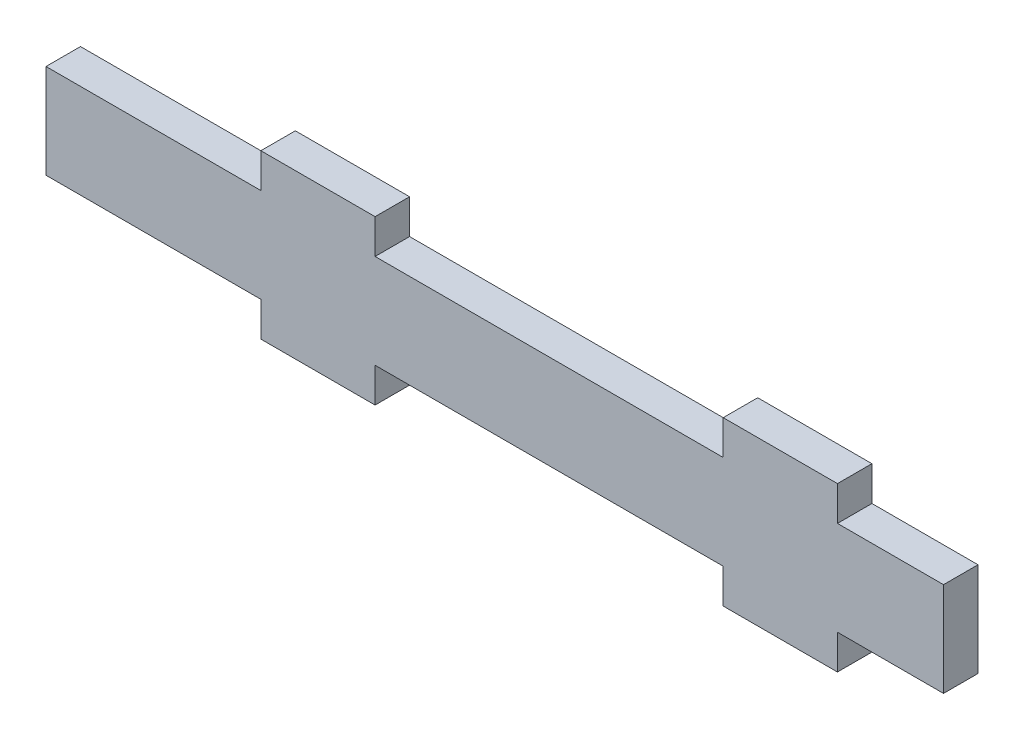
ISO-10303-21;
HEADER;
FILE_DESCRIPTION(('STEP AP214'),'2;1');
FILE_NAME('part.step','',(''),(''),'','','');
FILE_SCHEMA(('AUTOMOTIVE_DESIGN { 1 0 10303 214 1 1 1 1 }'));
ENDSEC;
DATA;
#1=APPLICATION_CONTEXT('core data for automotive mechanical design processes');
#2=APPLICATION_PROTOCOL_DEFINITION('international standard','automotive_design',2000,#1);
#3=PRODUCT_CONTEXT('',#1,'mechanical');
#4=PRODUCT('Part','Part','',(#3));
#5=PRODUCT_RELATED_PRODUCT_CATEGORY('part','',(#4));
#6=PRODUCT_DEFINITION_FORMATION('','',#4);
#7=PRODUCT_DEFINITION_CONTEXT('part definition',#1,'design');
#8=PRODUCT_DEFINITION('design','',#6,#7);
#9=PRODUCT_DEFINITION_SHAPE('','',#8);
#10=(LENGTH_UNIT() NAMED_UNIT(*) SI_UNIT(.MILLI.,.METRE.));
#11=(NAMED_UNIT(*) PLANE_ANGLE_UNIT() SI_UNIT($,.RADIAN.));
#12=(NAMED_UNIT(*) SI_UNIT($,.STERADIAN.) SOLID_ANGLE_UNIT());
#13=UNCERTAINTY_MEASURE_WITH_UNIT(LENGTH_MEASURE(1.E-05),#10,'distance_accuracy_value','');
#14=(GEOMETRIC_REPRESENTATION_CONTEXT(3) GLOBAL_UNCERTAINTY_ASSIGNED_CONTEXT((#13)) GLOBAL_UNIT_ASSIGNED_CONTEXT((#10,
#11,#12)) REPRESENTATION_CONTEXT('',''));
#15=CARTESIAN_POINT('',(0.,0.,0.));
#16=DIRECTION('',(0.,0.,1.));
#17=DIRECTION('',(1.,0.,0.));
#18=AXIS2_PLACEMENT_3D('',#15,#16,#17);
#19=CARTESIAN_POINT('',(0.,8.65999999999999,3.17));
#20=DIRECTION('',(0.,1.,0.));
#21=DIRECTION('',(-1.,0.,0.));
#22=AXIS2_PLACEMENT_3D('',#19,#20,#21);
#23=PLANE('',#22);
#24=DIRECTION('',(1.,0.,0.));
#25=VECTOR('',#24,1.);
#26=CARTESIAN_POINT('',(0.,8.65999999999999,0.));
#27=LINE('',#26,#25);
#28=CARTESIAN_POINT('',(0.,8.65999999999999,0.));
#29=VERTEX_POINT('',#28);
#30=CARTESIAN_POINT('',(19.75,8.66,0.));
#31=VERTEX_POINT('',#30);
#32=EDGE_CURVE('E230',#29,#31,#27,.T.);
#33=ORIENTED_EDGE('',*,*,#32,.F.);
#34=DIRECTION('',(0.,0.,-1.));
#35=VECTOR('',#34,1.);
#36=CARTESIAN_POINT('',(0.,8.65999999999999,3.17));
#37=LINE('',#36,#35);
#38=CARTESIAN_POINT('',(0.,8.65999999999999,3.17));
#39=VERTEX_POINT('',#38);
#40=EDGE_CURVE('E256',#39,#29,#37,.T.);
#41=ORIENTED_EDGE('',*,*,#40,.F.);
#42=DIRECTION('',(1.,0.,0.));
#43=VECTOR('',#42,1.);
#44=CARTESIAN_POINT('',(0.,8.65999999999999,3.17));
#45=LINE('',#44,#43);
#46=CARTESIAN_POINT('',(19.75,8.66,3.17));
#47=VERTEX_POINT('',#46);
#48=EDGE_CURVE('E350',#39,#47,#45,.T.);
#49=ORIENTED_EDGE('',*,*,#48,.T.);
#50=DIRECTION('',(0.,0.,-1.));
#51=VECTOR('',#50,1.);
#52=CARTESIAN_POINT('',(19.75,8.66,3.17));
#53=LINE('',#52,#51);
#54=EDGE_CURVE('E259',#47,#31,#53,.T.);
#55=ORIENTED_EDGE('',*,*,#54,.T.);
#56=EDGE_LOOP('',(#33,#41,#49,#55));
#57=FACE_BOUND('',#56,.T.);
#58=ADVANCED_FACE('F83',(#57),#23,.T.);
#59=CARTESIAN_POINT('',(19.75,0.,3.17));
#60=DIRECTION('',(-1.,0.,0.));
#61=DIRECTION('',(0.,0.,1.));
#62=AXIS2_PLACEMENT_3D('',#59,#60,#61);
#63=PLANE('',#62);
#64=DIRECTION('',(0.,1.,0.));
#65=VECTOR('',#64,1.);
#66=CARTESIAN_POINT('',(19.75,0.,0.));
#67=LINE('',#66,#65);
#68=CARTESIAN_POINT('',(19.75,11.83,0.));
#69=VERTEX_POINT('',#68);
#70=EDGE_CURVE('E246',#31,#69,#67,.T.);
#71=ORIENTED_EDGE('',*,*,#70,.F.);
#72=ORIENTED_EDGE('',*,*,#54,.F.);
#73=DIRECTION('',(0.,1.,0.));
#74=VECTOR('',#73,1.);
#75=CARTESIAN_POINT('',(19.75,0.,3.17));
#76=LINE('',#75,#74);
#77=CARTESIAN_POINT('',(19.75,11.83,3.17));
#78=VERTEX_POINT('',#77);
#79=EDGE_CURVE('E364',#47,#78,#76,.T.);
#80=ORIENTED_EDGE('',*,*,#79,.T.);
#81=DIRECTION('',(0.,0.,-1.));
#82=VECTOR('',#81,1.);
#83=CARTESIAN_POINT('',(19.75,11.83,3.17));
#84=LINE('',#83,#82);
#85=EDGE_CURVE('E262',#78,#69,#84,.T.);
#86=ORIENTED_EDGE('',*,*,#85,.T.);
#87=EDGE_LOOP('',(#71,#72,#80,#86));
#88=FACE_BOUND('',#87,.T.);
#89=ADVANCED_FACE('F415',(#88),#63,.T.);
#90=CARTESIAN_POINT('',(0.,11.83,3.17));
#91=DIRECTION('',(0.,1.,0.));
#92=DIRECTION('',(-1.,0.,0.));
#93=AXIS2_PLACEMENT_3D('',#90,#91,#92);
#94=PLANE('',#93);
#95=DIRECTION('',(1.,0.,0.));
#96=VECTOR('',#95,1.);
#97=CARTESIAN_POINT('',(0.,11.83,0.));
#98=LINE('',#97,#96);
#99=CARTESIAN_POINT('',(30.25,11.83,0.));
#100=VERTEX_POINT('',#99);
#101=EDGE_CURVE('E243',#69,#100,#98,.T.);
#102=ORIENTED_EDGE('',*,*,#101,.F.);
#103=ORIENTED_EDGE('',*,*,#85,.F.);
#104=DIRECTION('',(1.,0.,0.));
#105=VECTOR('',#104,1.);
#106=CARTESIAN_POINT('',(0.,11.83,3.17));
#107=LINE('',#106,#105);
#108=CARTESIAN_POINT('',(30.25,11.83,3.17));
#109=VERTEX_POINT('',#108);
#110=EDGE_CURVE('E362',#78,#109,#107,.T.);
#111=ORIENTED_EDGE('',*,*,#110,.T.);
#112=DIRECTION('',(0.,0.,-1.));
#113=VECTOR('',#112,1.);
#114=CARTESIAN_POINT('',(30.25,11.83,3.17));
#115=LINE('',#114,#113);
#116=EDGE_CURVE('E265',#109,#100,#115,.T.);
#117=ORIENTED_EDGE('',*,*,#116,.T.);
#118=EDGE_LOOP('',(#102,#103,#111,#117));
#119=FACE_BOUND('',#118,.T.);
#120=ADVANCED_FACE('F413',(#119),#94,.T.);
#121=CARTESIAN_POINT('',(30.25,0.,3.17));
#122=DIRECTION('',(-1.,0.,0.));
#123=DIRECTION('',(0.,-1.,0.));
#124=AXIS2_PLACEMENT_3D('',#121,#122,#123);
#125=PLANE('',#124);
#126=DIRECTION('',(0.,1.,0.));
#127=VECTOR('',#126,1.);
#128=CARTESIAN_POINT('',(30.25,0.,0.));
#129=LINE('',#128,#127);
#130=CARTESIAN_POINT('',(30.25,8.66,0.));
#131=VERTEX_POINT('',#130);
#132=EDGE_CURVE('E240',#131,#100,#129,.T.);
#133=ORIENTED_EDGE('',*,*,#132,.T.);
#134=ORIENTED_EDGE('',*,*,#116,.F.);
#135=DIRECTION('',(0.,1.,0.));
#136=VECTOR('',#135,1.);
#137=CARTESIAN_POINT('',(30.25,0.,3.17));
#138=LINE('',#137,#136);
#139=CARTESIAN_POINT('',(30.25,8.66,3.17));
#140=VERTEX_POINT('',#139);
#141=EDGE_CURVE('E359',#140,#109,#138,.T.);
#142=ORIENTED_EDGE('',*,*,#141,.F.);
#143=DIRECTION('',(0.,0.,-1.));
#144=VECTOR('',#143,1.);
#145=CARTESIAN_POINT('',(30.25,8.66,3.17));
#146=LINE('',#145,#144);
#147=EDGE_CURVE('E268',#140,#131,#146,.T.);
#148=ORIENTED_EDGE('',*,*,#147,.T.);
#149=EDGE_LOOP('',(#133,#134,#142,#148));
#150=FACE_BOUND('',#149,.T.);
#151=ADVANCED_FACE('F420',(#150),#125,.F.);
#152=CARTESIAN_POINT('',(62.25,8.66,0.));
#153=VERTEX_POINT('',#152);
#154=EDGE_CURVE('E231',#131,#153,#27,.T.);
#155=ORIENTED_EDGE('',*,*,#154,.F.);
#156=ORIENTED_EDGE('',*,*,#147,.F.);
#157=CARTESIAN_POINT('',(62.25,8.66,3.17));
#158=VERTEX_POINT('',#157);
#159=EDGE_CURVE('E351',#140,#158,#45,.T.);
#160=ORIENTED_EDGE('',*,*,#159,.T.);
#161=DIRECTION('',(0.,0.,-1.));
#162=VECTOR('',#161,1.);
#163=CARTESIAN_POINT('',(62.25,8.66,3.17));
#164=LINE('',#163,#162);
#165=EDGE_CURVE('E271',#158,#153,#164,.T.);
#166=ORIENTED_EDGE('',*,*,#165,.T.);
#167=EDGE_LOOP('',(#155,#156,#160,#166));
#168=FACE_BOUND('',#167,.T.);
#169=ADVANCED_FACE('F382',(#168),#23,.T.);
#170=CARTESIAN_POINT('',(62.25,0.,3.17));
#171=DIRECTION('',(-1.,0.,0.));
#172=DIRECTION('',(0.,0.,1.));
#173=AXIS2_PLACEMENT_3D('',#170,#171,#172);
#174=PLANE('',#173);
#175=DIRECTION('',(0.,1.,0.));
#176=VECTOR('',#175,1.);
#177=CARTESIAN_POINT('',(62.25,0.,0.));
#178=LINE('',#177,#176);
#179=CARTESIAN_POINT('',(62.25,11.83,0.));
#180=VERTEX_POINT('',#179);
#181=EDGE_CURVE('E237',#153,#180,#178,.T.);
#182=ORIENTED_EDGE('',*,*,#181,.F.);
#183=ORIENTED_EDGE('',*,*,#165,.F.);
#184=DIRECTION('',(0.,1.,0.));
#185=VECTOR('',#184,1.);
#186=CARTESIAN_POINT('',(62.25,0.,3.17));
#187=LINE('',#186,#185);
#188=CARTESIAN_POINT('',(62.25,11.83,3.17));
#189=VERTEX_POINT('',#188);
#190=EDGE_CURVE('E356',#158,#189,#187,.T.);
#191=ORIENTED_EDGE('',*,*,#190,.T.);
#192=DIRECTION('',(0.,0.,-1.));
#193=VECTOR('',#192,1.);
#194=CARTESIAN_POINT('',(62.25,11.83,3.17));
#195=LINE('',#194,#193);
#196=EDGE_CURVE('E274',#189,#180,#195,.T.);
#197=ORIENTED_EDGE('',*,*,#196,.T.);
#198=EDGE_LOOP('',(#182,#183,#191,#197));
#199=FACE_BOUND('',#198,.T.);
#200=ADVANCED_FACE('F427',(#199),#174,.T.);
#201=CARTESIAN_POINT('',(0.,11.83,3.17));
#202=DIRECTION('',(0.,1.,0.));
#203=DIRECTION('',(-1.,0.,0.));
#204=AXIS2_PLACEMENT_3D('',#201,#202,#203);
#205=PLANE('',#204);
#206=DIRECTION('',(1.,0.,0.));
#207=VECTOR('',#206,1.);
#208=CARTESIAN_POINT('',(0.,11.83,0.));
#209=LINE('',#208,#207);
#210=CARTESIAN_POINT('',(72.75,11.83,0.));
#211=VERTEX_POINT('',#210);
#212=EDGE_CURVE('E234',#180,#211,#209,.T.);
#213=ORIENTED_EDGE('',*,*,#212,.F.);
#214=ORIENTED_EDGE('',*,*,#196,.F.);
#215=DIRECTION('',(1.,0.,0.));
#216=VECTOR('',#215,1.);
#217=CARTESIAN_POINT('',(0.,11.83,3.17));
#218=LINE('',#217,#216);
#219=CARTESIAN_POINT('',(72.75,11.83,3.17));
#220=VERTEX_POINT('',#219);
#221=EDGE_CURVE('E353',#189,#220,#218,.T.);
#222=ORIENTED_EDGE('',*,*,#221,.T.);
#223=DIRECTION('',(0.,0.,-1.));
#224=VECTOR('',#223,1.);
#225=CARTESIAN_POINT('',(72.75,11.83,3.17));
#226=LINE('',#225,#224);
#227=EDGE_CURVE('E277',#220,#211,#226,.T.);
#228=ORIENTED_EDGE('',*,*,#227,.T.);
#229=EDGE_LOOP('',(#213,#214,#222,#228));
#230=FACE_BOUND('',#229,.T.);
#231=ADVANCED_FACE('F442',(#230),#205,.T.);
#232=CARTESIAN_POINT('',(72.75,0.,3.17));
#233=DIRECTION('',(-1.,0.,0.));
#234=DIRECTION('',(0.,0.,1.));
#235=AXIS2_PLACEMENT_3D('',#232,#233,#234);
#236=PLANE('',#235);
#237=DIRECTION('',(0.,1.,0.));
#238=VECTOR('',#237,1.);
#239=CARTESIAN_POINT('',(72.75,0.,0.));
#240=LINE('',#239,#238);
#241=CARTESIAN_POINT('',(72.75,8.66,0.));
#242=VERTEX_POINT('',#241);
#243=EDGE_CURVE('E229',#242,#211,#240,.T.);
#244=ORIENTED_EDGE('',*,*,#243,.T.);
#245=ORIENTED_EDGE('',*,*,#227,.F.);
#246=DIRECTION('',(0.,1.,0.));
#247=VECTOR('',#246,1.);
#248=CARTESIAN_POINT('',(72.75,0.,3.17));
#249=LINE('',#248,#247);
#250=CARTESIAN_POINT('',(72.75,8.66,3.17));
#251=VERTEX_POINT('',#250);
#252=EDGE_CURVE('E290',#251,#220,#249,.T.);
#253=ORIENTED_EDGE('',*,*,#252,.F.);
#254=DIRECTION('',(0.,0.,-1.));
#255=VECTOR('',#254,1.);
#256=CARTESIAN_POINT('',(72.75,8.66,3.17));
#257=LINE('',#256,#255);
#258=EDGE_CURVE('E175',#251,#242,#257,.T.);
#259=ORIENTED_EDGE('',*,*,#258,.T.);
#260=EDGE_LOOP('',(#244,#245,#253,#259));
#261=FACE_BOUND('',#260,.T.);
#262=ADVANCED_FACE('F285',(#261),#236,.F.);
#263=CARTESIAN_POINT('',(82.5,8.66,0.));
#264=VERTEX_POINT('',#263);
#265=EDGE_CURVE('E226',#242,#264,#27,.T.);
#266=ORIENTED_EDGE('',*,*,#265,.F.);
#267=ORIENTED_EDGE('',*,*,#258,.F.);
#268=CARTESIAN_POINT('',(82.5,8.66,3.17));
#269=VERTEX_POINT('',#268);
#270=EDGE_CURVE('E301',#251,#269,#45,.T.);
#271=ORIENTED_EDGE('',*,*,#270,.T.);
#272=DIRECTION('',(0.,0.,-1.));
#273=VECTOR('',#272,1.);
#274=CARTESIAN_POINT('',(82.5,8.66,3.17));
#275=LINE('',#274,#273);
#276=EDGE_CURVE('E168',#269,#264,#275,.T.);
#277=ORIENTED_EDGE('',*,*,#276,.T.);
#278=EDGE_LOOP('',(#266,#267,#271,#277));
#279=FACE_BOUND('',#278,.T.);
#280=ADVANCED_FACE('F298',(#279),#23,.T.);
#281=CARTESIAN_POINT('',(0.,0.,3.17));
#282=DIRECTION('',(-1.,0.,0.));
#283=DIRECTION('',(0.,0.,1.));
#284=AXIS2_PLACEMENT_3D('',#281,#282,#283);
#285=PLANE('',#284);
#286=DIRECTION('',(0.,1.,0.));
#287=VECTOR('',#286,1.);
#288=CARTESIAN_POINT('',(0.,0.,0.));
#289=LINE('',#288,#287);
#290=CARTESIAN_POINT('',(0.,0.,0.));
#291=VERTEX_POINT('',#290);
#292=EDGE_CURVE('E249',#291,#29,#289,.T.);
#293=ORIENTED_EDGE('',*,*,#292,.F.);
#294=DIRECTION('',(0.,0.,-1.));
#295=VECTOR('',#294,1.);
#296=CARTESIAN_POINT('',(0.,0.,3.17));
#297=LINE('',#296,#295);
#298=CARTESIAN_POINT('',(0.,0.,3.17));
#299=VERTEX_POINT('',#298);
#300=EDGE_CURVE('E253',#299,#291,#297,.T.);
#301=ORIENTED_EDGE('',*,*,#300,.F.);
#302=DIRECTION('',(0.,1.,0.));
#303=VECTOR('',#302,1.);
#304=CARTESIAN_POINT('',(0.,0.,3.17));
#305=LINE('',#304,#303);
#306=EDGE_CURVE('E223',#299,#39,#305,.T.);
#307=ORIENTED_EDGE('',*,*,#306,.T.);
#308=ORIENTED_EDGE('',*,*,#40,.T.);
#309=EDGE_LOOP('',(#293,#301,#307,#308));
#310=FACE_BOUND('',#309,.T.);
#311=ADVANCED_FACE('F406',(#310),#285,.T.);
#312=CARTESIAN_POINT('',(82.5,0.,3.17));
#313=DIRECTION('',(-1.,0.,0.));
#314=DIRECTION('',(0.,0.,1.));
#315=AXIS2_PLACEMENT_3D('',#312,#313,#314);
#316=PLANE('',#315);
#317=DIRECTION('',(0.,1.,0.));
#318=VECTOR('',#317,1.);
#319=CARTESIAN_POINT('',(82.5,0.,0.));
#320=LINE('',#319,#318);
#321=CARTESIAN_POINT('',(82.5,0.,0.));
#322=VERTEX_POINT('',#321);
#323=EDGE_CURVE('E220',#322,#264,#320,.T.);
#324=ORIENTED_EDGE('',*,*,#323,.T.);
#325=ORIENTED_EDGE('',*,*,#276,.F.);
#326=DIRECTION('',(0.,1.,0.));
#327=VECTOR('',#326,1.);
#328=CARTESIAN_POINT('',(82.5,0.,3.17));
#329=LINE('',#328,#327);
#330=CARTESIAN_POINT('',(82.5,0.,3.17));
#331=VERTEX_POINT('',#330);
#332=EDGE_CURVE('E344',#331,#269,#329,.T.);
#333=ORIENTED_EDGE('',*,*,#332,.F.);
#334=DIRECTION('',(0.,0.,-1.));
#335=VECTOR('',#334,1.);
#336=CARTESIAN_POINT('',(82.5,0.,3.17));
#337=LINE('',#336,#335);
#338=EDGE_CURVE('E164',#331,#322,#337,.T.);
#339=ORIENTED_EDGE('',*,*,#338,.T.);
#340=EDGE_LOOP('',(#324,#325,#333,#339));
#341=FACE_BOUND('',#340,.T.);
#342=ADVANCED_FACE('F303',(#341),#316,.F.);
#343=CARTESIAN_POINT('',(0.,0.,0.));
#344=DIRECTION('',(0.,0.,1.));
#345=DIRECTION('',(1.,0.,0.));
#346=AXIS2_PLACEMENT_3D('',#343,#344,#345);
#347=PLANE('',#346);
#348=DIRECTION('',(1.,0.,0.));
#349=VECTOR('',#348,1.);
#350=CARTESIAN_POINT('',(0.,0.,0.));
#351=LINE('',#350,#349);
#352=CARTESIAN_POINT('',(19.75,0.,0.));
#353=VERTEX_POINT('',#352);
#354=EDGE_CURVE('E217',#291,#353,#351,.T.);
#355=ORIENTED_EDGE('',*,*,#354,.F.);
#356=ORIENTED_EDGE('',*,*,#292,.T.);
#357=ORIENTED_EDGE('',*,*,#32,.T.);
#358=ORIENTED_EDGE('',*,*,#70,.T.);
#359=ORIENTED_EDGE('',*,*,#101,.T.);
#360=ORIENTED_EDGE('',*,*,#132,.F.);
#361=ORIENTED_EDGE('',*,*,#154,.T.);
#362=ORIENTED_EDGE('',*,*,#181,.T.);
#363=ORIENTED_EDGE('',*,*,#212,.T.);
#364=ORIENTED_EDGE('',*,*,#243,.F.);
#365=ORIENTED_EDGE('',*,*,#265,.T.);
#366=ORIENTED_EDGE('',*,*,#323,.F.);
#367=CARTESIAN_POINT('',(72.75,0.,0.));
#368=VERTEX_POINT('',#367);
#369=EDGE_CURVE('E153',#368,#322,#351,.T.);
#370=ORIENTED_EDGE('',*,*,#369,.F.);
#371=DIRECTION('',(0.,-1.,0.));
#372=VECTOR('',#371,1.);
#373=CARTESIAN_POINT('',(72.75,0.,0.));
#374=LINE('',#373,#372);
#375=CARTESIAN_POINT('',(72.75,-3.17000000000001,0.));
#376=VERTEX_POINT('',#375);
#377=EDGE_CURVE('E140',#368,#376,#374,.T.);
#378=ORIENTED_EDGE('',*,*,#377,.T.);
#379=DIRECTION('',(1.,0.,0.));
#380=VECTOR('',#379,1.);
#381=CARTESIAN_POINT('',(62.25,-3.17000000000001,0.));
#382=LINE('',#381,#380);
#383=CARTESIAN_POINT('',(62.25,-3.17000000000001,0.));
#384=VERTEX_POINT('',#383);
#385=EDGE_CURVE('E133',#384,#376,#382,.T.);
#386=ORIENTED_EDGE('',*,*,#385,.F.);
#387=DIRECTION('',(0.,-1.,0.));
#388=VECTOR('',#387,1.);
#389=CARTESIAN_POINT('',(62.25,0.,0.));
#390=LINE('',#389,#388);
#391=CARTESIAN_POINT('',(62.25,0.,0.));
#392=VERTEX_POINT('',#391);
#393=EDGE_CURVE('E147',#392,#384,#390,.T.);
#394=ORIENTED_EDGE('',*,*,#393,.F.);
#395=CARTESIAN_POINT('',(30.25,0.,0.));
#396=VERTEX_POINT('',#395);
#397=EDGE_CURVE('E210',#396,#392,#351,.T.);
#398=ORIENTED_EDGE('',*,*,#397,.F.);
#399=DIRECTION('',(0.,-1.,0.));
#400=VECTOR('',#399,1.);
#401=CARTESIAN_POINT('',(30.25,0.,0.));
#402=LINE('',#401,#400);
#403=CARTESIAN_POINT('',(30.25,-3.17,0.));
#404=VERTEX_POINT('',#403);
#405=EDGE_CURVE('E183',#396,#404,#402,.T.);
#406=ORIENTED_EDGE('',*,*,#405,.T.);
#407=DIRECTION('',(1.,0.,0.));
#408=VECTOR('',#407,1.);
#409=CARTESIAN_POINT('',(19.75,-3.17,0.));
#410=LINE('',#409,#408);
#411=CARTESIAN_POINT('',(19.75,-3.17,0.));
#412=VERTEX_POINT('',#411);
#413=EDGE_CURVE('E192',#412,#404,#410,.T.);
#414=ORIENTED_EDGE('',*,*,#413,.F.);
#415=DIRECTION('',(0.,-1.,0.));
#416=VECTOR('',#415,1.);
#417=CARTESIAN_POINT('',(19.75,0.,0.));
#418=LINE('',#417,#416);
#419=EDGE_CURVE('E189',#353,#412,#418,.T.);
#420=ORIENTED_EDGE('',*,*,#419,.F.);
#421=EDGE_LOOP('',(#355,#356,#357,#358,#359,#360,#361,#362,#363,#364,#365,#366,#370,#378,#386,
#394,#398,#406,#414,#420));
#422=FACE_BOUND('',#421,.T.);
#423=ADVANCED_FACE('F150',(#422),#347,.F.);
#424=CARTESIAN_POINT('',(0.,0.,3.17));
#425=DIRECTION('',(0.,0.,1.));
#426=DIRECTION('',(1.,0.,0.));
#427=AXIS2_PLACEMENT_3D('',#424,#425,#426);
#428=PLANE('',#427);
#429=DIRECTION('',(1.,0.,0.));
#430=VECTOR('',#429,1.);
#431=CARTESIAN_POINT('',(0.,0.,3.17));
#432=LINE('',#431,#430);
#433=CARTESIAN_POINT('',(19.75,0.,3.17));
#434=VERTEX_POINT('',#433);
#435=EDGE_CURVE('E342',#299,#434,#432,.T.);
#436=ORIENTED_EDGE('',*,*,#435,.T.);
#437=DIRECTION('',(0.,-1.,0.));
#438=VECTOR('',#437,1.);
#439=CARTESIAN_POINT('',(19.75,0.,3.17));
#440=LINE('',#439,#438);
#441=CARTESIAN_POINT('',(19.75,-3.17,3.17));
#442=VERTEX_POINT('',#441);
#443=EDGE_CURVE('E179',#434,#442,#440,.T.);
#444=ORIENTED_EDGE('',*,*,#443,.T.);
#445=DIRECTION('',(1.,0.,0.));
#446=VECTOR('',#445,1.);
#447=CARTESIAN_POINT('',(19.75,-3.17,3.17));
#448=LINE('',#447,#446);
#449=CARTESIAN_POINT('',(30.25,-3.17,3.17));
#450=VERTEX_POINT('',#449);
#451=EDGE_CURVE('E182',#442,#450,#448,.T.);
#452=ORIENTED_EDGE('',*,*,#451,.T.);
#453=DIRECTION('',(0.,-1.,0.));
#454=VECTOR('',#453,1.);
#455=CARTESIAN_POINT('',(30.25,0.,3.17));
#456=LINE('',#455,#454);
#457=CARTESIAN_POINT('',(30.25,0.,3.17));
#458=VERTEX_POINT('',#457);
#459=EDGE_CURVE('E185',#458,#450,#456,.T.);
#460=ORIENTED_EDGE('',*,*,#459,.F.);
#461=CARTESIAN_POINT('',(62.25,0.,3.17));
#462=VERTEX_POINT('',#461);
#463=EDGE_CURVE('E340',#458,#462,#432,.T.);
#464=ORIENTED_EDGE('',*,*,#463,.T.);
#465=DIRECTION('',(0.,-1.,0.));
#466=VECTOR('',#465,1.);
#467=CARTESIAN_POINT('',(62.25,0.,3.17));
#468=LINE('',#467,#466);
#469=CARTESIAN_POINT('',(62.25,-3.17000000000001,3.17));
#470=VERTEX_POINT('',#469);
#471=EDGE_CURVE('E154',#462,#470,#468,.T.);
#472=ORIENTED_EDGE('',*,*,#471,.T.);
#473=DIRECTION('',(1.,0.,0.));
#474=VECTOR('',#473,1.);
#475=CARTESIAN_POINT('',(62.25,-3.17000000000001,3.17));
#476=LINE('',#475,#474);
#477=CARTESIAN_POINT('',(72.75,-3.17000000000001,3.17));
#478=VERTEX_POINT('',#477);
#479=EDGE_CURVE('E157',#470,#478,#476,.T.);
#480=ORIENTED_EDGE('',*,*,#479,.T.);
#481=DIRECTION('',(0.,-1.,0.));
#482=VECTOR('',#481,1.);
#483=CARTESIAN_POINT('',(72.75,0.,3.17));
#484=LINE('',#483,#482);
#485=CARTESIAN_POINT('',(72.75,0.,3.17));
#486=VERTEX_POINT('',#485);
#487=EDGE_CURVE('E142',#486,#478,#484,.T.);
#488=ORIENTED_EDGE('',*,*,#487,.F.);
#489=EDGE_CURVE('E252',#486,#331,#432,.T.);
#490=ORIENTED_EDGE('',*,*,#489,.T.);
#491=ORIENTED_EDGE('',*,*,#332,.T.);
#492=ORIENTED_EDGE('',*,*,#270,.F.);
#493=ORIENTED_EDGE('',*,*,#252,.T.);
#494=ORIENTED_EDGE('',*,*,#221,.F.);
#495=ORIENTED_EDGE('',*,*,#190,.F.);
#496=ORIENTED_EDGE('',*,*,#159,.F.);
#497=ORIENTED_EDGE('',*,*,#141,.T.);
#498=ORIENTED_EDGE('',*,*,#110,.F.);
#499=ORIENTED_EDGE('',*,*,#79,.F.);
#500=ORIENTED_EDGE('',*,*,#48,.F.);
#501=ORIENTED_EDGE('',*,*,#306,.F.);
#502=EDGE_LOOP('',(#436,#444,#452,#460,#464,#472,#480,#488,#490,#491,#492,#493,#494,#495,#496,
#497,#498,#499,#500,#501));
#503=FACE_BOUND('',#502,.T.);
#504=ADVANCED_FACE('F339',(#503),#428,.T.);
#505=CARTESIAN_POINT('',(0.,0.,3.17));
#506=DIRECTION('',(0.,1.,0.));
#507=DIRECTION('',(0.,0.,1.));
#508=AXIS2_PLACEMENT_3D('',#505,#506,#507);
#509=PLANE('',#508);
#510=ORIENTED_EDGE('',*,*,#489,.F.);
#511=DIRECTION('',(0.,0.,-1.));
#512=VECTOR('',#511,1.);
#513=CARTESIAN_POINT('',(72.75,0.,3.17));
#514=LINE('',#513,#512);
#515=EDGE_CURVE('E102',#486,#368,#514,.T.);
#516=ORIENTED_EDGE('',*,*,#515,.T.);
#517=ORIENTED_EDGE('',*,*,#369,.T.);
#518=ORIENTED_EDGE('',*,*,#338,.F.);
#519=EDGE_LOOP('',(#510,#516,#517,#518));
#520=FACE_BOUND('',#519,.T.);
#521=ADVANCED_FACE('F452',(#520),#509,.F.);
#522=ORIENTED_EDGE('',*,*,#463,.F.);
#523=DIRECTION('',(0.,0.,-1.));
#524=VECTOR('',#523,1.);
#525=CARTESIAN_POINT('',(30.25,0.,3.17));
#526=LINE('',#525,#524);
#527=EDGE_CURVE('E93',#458,#396,#526,.T.);
#528=ORIENTED_EDGE('',*,*,#527,.T.);
#529=ORIENTED_EDGE('',*,*,#397,.T.);
#530=DIRECTION('',(0.,0.,-1.));
#531=VECTOR('',#530,1.);
#532=CARTESIAN_POINT('',(62.25,0.,3.17));
#533=LINE('',#532,#531);
#534=EDGE_CURVE('E161',#462,#392,#533,.T.);
#535=ORIENTED_EDGE('',*,*,#534,.F.);
#536=EDGE_LOOP('',(#522,#528,#529,#535));
#537=FACE_BOUND('',#536,.T.);
#538=ADVANCED_FACE('F214',(#537),#509,.F.);
#539=DIRECTION('',(0.,0.,-1.));
#540=VECTOR('',#539,1.);
#541=CARTESIAN_POINT('',(19.75,0.,3.17));
#542=LINE('',#541,#540);
#543=EDGE_CURVE('E12',#434,#353,#542,.T.);
#544=ORIENTED_EDGE('',*,*,#543,.F.);
#545=ORIENTED_EDGE('',*,*,#435,.F.);
#546=ORIENTED_EDGE('',*,*,#300,.T.);
#547=ORIENTED_EDGE('',*,*,#354,.T.);
#548=EDGE_LOOP('',(#544,#545,#546,#547));
#549=FACE_BOUND('',#548,.T.);
#550=ADVANCED_FACE('F409',(#549),#509,.F.);
#551=CARTESIAN_POINT('',(62.25,-3.17000000000001,3.17));
#552=DIRECTION('',(0.,1.,0.));
#553=DIRECTION('',(-1.,0.,0.));
#554=AXIS2_PLACEMENT_3D('',#551,#552,#553);
#555=PLANE('',#554);
#556=ORIENTED_EDGE('',*,*,#385,.T.);
#557=DIRECTION('',(0.,0.,-1.));
#558=VECTOR('',#557,1.);
#559=CARTESIAN_POINT('',(72.75,-3.17000000000001,3.17));
#560=LINE('',#559,#558);
#561=EDGE_CURVE('E137',#478,#376,#560,.T.);
#562=ORIENTED_EDGE('',*,*,#561,.F.);
#563=ORIENTED_EDGE('',*,*,#479,.F.);
#564=DIRECTION('',(0.,0.,-1.));
#565=VECTOR('',#564,1.);
#566=CARTESIAN_POINT('',(62.25,-3.17000000000001,3.17));
#567=LINE('',#566,#565);
#568=EDGE_CURVE('E87',#470,#384,#567,.T.);
#569=ORIENTED_EDGE('',*,*,#568,.T.);
#570=EDGE_LOOP('',(#556,#562,#563,#569));
#571=FACE_BOUND('',#570,.T.);
#572=ADVANCED_FACE('F144',(#571),#555,.F.);
#573=CARTESIAN_POINT('',(72.75,0.,3.17));
#574=DIRECTION('',(1.,0.,0.));
#575=DIRECTION('',(0.,0.,-1.));
#576=AXIS2_PLACEMENT_3D('',#573,#574,#575);
#577=PLANE('',#576);
#578=ORIENTED_EDGE('',*,*,#377,.F.);
#579=ORIENTED_EDGE('',*,*,#515,.F.);
#580=ORIENTED_EDGE('',*,*,#487,.T.);
#581=ORIENTED_EDGE('',*,*,#561,.T.);
#582=EDGE_LOOP('',(#578,#579,#580,#581));
#583=FACE_BOUND('',#582,.T.);
#584=ADVANCED_FACE('F138',(#583),#577,.T.);
#585=CARTESIAN_POINT('',(62.25,0.,3.17));
#586=DIRECTION('',(1.,0.,0.));
#587=DIRECTION('',(0.,1.,0.));
#588=AXIS2_PLACEMENT_3D('',#585,#586,#587);
#589=PLANE('',#588);
#590=ORIENTED_EDGE('',*,*,#393,.T.);
#591=ORIENTED_EDGE('',*,*,#568,.F.);
#592=ORIENTED_EDGE('',*,*,#471,.F.);
#593=ORIENTED_EDGE('',*,*,#534,.T.);
#594=EDGE_LOOP('',(#590,#591,#592,#593));
#595=FACE_BOUND('',#594,.T.);
#596=ADVANCED_FACE('F85',(#595),#589,.F.);
#597=CARTESIAN_POINT('',(19.75,-3.17,3.17));
#598=DIRECTION('',(0.,1.,0.));
#599=DIRECTION('',(-1.,0.,0.));
#600=AXIS2_PLACEMENT_3D('',#597,#598,#599);
#601=PLANE('',#600);
#602=ORIENTED_EDGE('',*,*,#413,.T.);
#603=DIRECTION('',(0.,0.,-1.));
#604=VECTOR('',#603,1.);
#605=CARTESIAN_POINT('',(30.25,-3.17,3.17));
#606=LINE('',#605,#604);
#607=EDGE_CURVE('E188',#450,#404,#606,.T.);
#608=ORIENTED_EDGE('',*,*,#607,.F.);
#609=ORIENTED_EDGE('',*,*,#451,.F.);
#610=DIRECTION('',(0.,0.,-1.));
#611=VECTOR('',#610,1.);
#612=CARTESIAN_POINT('',(19.75,-3.17,3.17));
#613=LINE('',#612,#611);
#614=EDGE_CURVE('E200',#442,#412,#613,.T.);
#615=ORIENTED_EDGE('',*,*,#614,.T.);
#616=EDGE_LOOP('',(#602,#608,#609,#615));
#617=FACE_BOUND('',#616,.T.);
#618=ADVANCED_FACE('F458',(#617),#601,.F.);
#619=CARTESIAN_POINT('',(30.25,0.,3.17));
#620=DIRECTION('',(1.,0.,0.));
#621=DIRECTION('',(0.,1.,0.));
#622=AXIS2_PLACEMENT_3D('',#619,#620,#621);
#623=PLANE('',#622);
#624=ORIENTED_EDGE('',*,*,#405,.F.);
#625=ORIENTED_EDGE('',*,*,#527,.F.);
#626=ORIENTED_EDGE('',*,*,#459,.T.);
#627=ORIENTED_EDGE('',*,*,#607,.T.);
#628=EDGE_LOOP('',(#624,#625,#626,#627));
#629=FACE_BOUND('',#628,.T.);
#630=ADVANCED_FACE('F335',(#629),#623,.T.);
#631=CARTESIAN_POINT('',(19.75,0.,3.17));
#632=DIRECTION('',(1.,0.,0.));
#633=DIRECTION('',(0.,0.,-1.));
#634=AXIS2_PLACEMENT_3D('',#631,#632,#633);
#635=PLANE('',#634);
#636=ORIENTED_EDGE('',*,*,#419,.T.);
#637=ORIENTED_EDGE('',*,*,#614,.F.);
#638=ORIENTED_EDGE('',*,*,#443,.F.);
#639=ORIENTED_EDGE('',*,*,#543,.T.);
#640=EDGE_LOOP('',(#636,#637,#638,#639));
#641=FACE_BOUND('',#640,.T.);
#642=ADVANCED_FACE('F457',(#641),#635,.F.);
#643=CLOSED_SHELL('',(#58,#89,#120,#151,#169,#200,#231,#262,#280,#311,#342,#423,#504,#521,#538,
#550,#572,#584,#596,#618,#630,#642));
#644=MANIFOLD_SOLID_BREP('B2',#643);
#645=ADVANCED_BREP_SHAPE_REPRESENTATION('',(#18,#644),#14);
#646=SHAPE_DEFINITION_REPRESENTATION(#9,#645);
ENDSEC;
END-ISO-10303-21;
